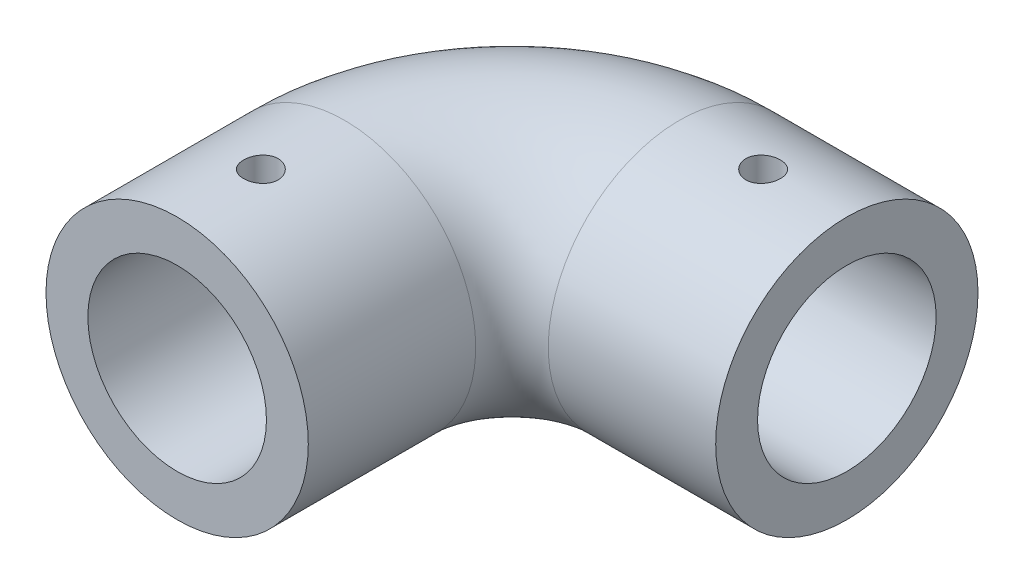
ISO-10303-21;
HEADER;
FILE_DESCRIPTION(('STEP AP214'),'2;1');
FILE_NAME('part.step','',(''),(''),'','','');
FILE_SCHEMA(('AUTOMOTIVE_DESIGN { 1 0 10303 214 1 1 1 1 }'));
ENDSEC;
DATA;
#1=APPLICATION_CONTEXT('core data for automotive mechanical design processes');
#2=APPLICATION_PROTOCOL_DEFINITION('international standard','automotive_design',2000,#1);
#3=PRODUCT_CONTEXT('',#1,'mechanical');
#4=PRODUCT('Part','Part','',(#3));
#5=PRODUCT_RELATED_PRODUCT_CATEGORY('part','',(#4));
#6=PRODUCT_DEFINITION_FORMATION('','',#4);
#7=PRODUCT_DEFINITION_CONTEXT('part definition',#1,'design');
#8=PRODUCT_DEFINITION('design','',#6,#7);
#9=PRODUCT_DEFINITION_SHAPE('','',#8);
#10=(LENGTH_UNIT() NAMED_UNIT(*) SI_UNIT(.MILLI.,.METRE.));
#11=(NAMED_UNIT(*) PLANE_ANGLE_UNIT() SI_UNIT($,.RADIAN.));
#12=(NAMED_UNIT(*) SI_UNIT($,.STERADIAN.) SOLID_ANGLE_UNIT());
#13=UNCERTAINTY_MEASURE_WITH_UNIT(LENGTH_MEASURE(1.E-05),#10,'distance_accuracy_value','');
#14=(GEOMETRIC_REPRESENTATION_CONTEXT(3) GLOBAL_UNCERTAINTY_ASSIGNED_CONTEXT((#13)) GLOBAL_UNIT_ASSIGNED_CONTEXT((#10,
#11,#12)) REPRESENTATION_CONTEXT('',''));
#15=CARTESIAN_POINT('',(0.,0.,0.));
#16=DIRECTION('',(0.,0.,1.));
#17=DIRECTION('',(1.,0.,0.));
#18=AXIS2_PLACEMENT_3D('',#15,#16,#17);
#19=CARTESIAN_POINT('',(0.,0.,0.));
#20=DIRECTION('',(0.,0.,-1.));
#21=DIRECTION('',(-1.,0.,0.));
#22=AXIS2_PLACEMENT_3D('',#19,#20,#21);
#23=CYLINDRICAL_SURFACE('',#22,23.5);
#24=CARTESIAN_POINT('',(0.,0.,-30.));
#25=DIRECTION('',(0.,0.,1.));
#26=DIRECTION('',(1.,0.,0.));
#27=AXIS2_PLACEMENT_3D('',#24,#25,#26);
#28=CIRCLE('',#27,23.5);
#29=CARTESIAN_POINT('',(-23.5,0.,-30.));
#30=VERTEX_POINT('',#29);
#31=EDGE_CURVE('E77',#30,#30,#28,.T.);
#32=ORIENTED_EDGE('',*,*,#31,.T.);
#33=EDGE_LOOP('',(#32));
#34=FACE_BOUND('',#33,.T.);
#35=CARTESIAN_POINT('',(0.,0.,0.));
#36=DIRECTION('',(0.,0.,1.));
#37=DIRECTION('',(1.,0.,0.));
#38=AXIS2_PLACEMENT_3D('',#35,#36,#37);
#39=CIRCLE('',#38,23.5);
#40=CARTESIAN_POINT('',(23.5,0.,0.));
#41=VERTEX_POINT('',#40);
#42=EDGE_CURVE('E72',#41,#41,#39,.T.);
#43=ORIENTED_EDGE('',*,*,#42,.F.);
#44=EDGE_LOOP('',(#43));
#45=FACE_BOUND('',#44,.T.);
#46=CARTESIAN_POINT('',(0.,23.5,-18.1));
#47=CARTESIAN_POINT('',(-0.173321031659221,23.4999974750277,-18.0999926879723));
#48=CARTESIAN_POINT('',(-0.346748373877283,23.4980623310897,-18.0854154023915));
#49=CARTESIAN_POINT('',(-0.688771561000183,23.4905288228196,-18.0274970424218));
#50=CARTESIAN_POINT('',(-0.857362263730753,23.4849267003003,-17.9841264579094));
#51=CARTESIAN_POINT('',(-1.18471161526422,23.4706899421908,-17.869926352));
#52=CARTESIAN_POINT('',(-1.34347700530939,23.462057413545,-17.7991159051159));
#53=CARTESIAN_POINT('',(-1.64684262133027,23.4427183403208,-17.632089166426));
#54=CARTESIAN_POINT('',(-1.79144515135038,23.4320121339395,-17.5358770164667));
#55=CARTESIAN_POINT('',(-2.06329159726113,23.4096467338321,-17.3201507293886));
#56=CARTESIAN_POINT('',(-2.1904365753566,23.3979826626349,-17.2005124091798));
#57=CARTESIAN_POINT('',(-2.42290623577125,23.3750551704837,-16.9415967283498));
#58=CARTESIAN_POINT('',(-2.52822977071607,23.3637917706228,-16.8023183356978));
#59=CARTESIAN_POINT('',(-2.71443987970265,23.3428931396758,-16.5074271751583));
#60=CARTESIAN_POINT('',(-2.79523293410607,23.3332641997659,-16.3517548696276));
#61=CARTESIAN_POINT('',(-2.92949133023861,23.3167897351994,-16.0289030431143));
#62=CARTESIAN_POINT('',(-2.98295782412488,23.3099440931945,-15.8617240076221));
#63=CARTESIAN_POINT('',(-3.06074291097747,23.2998583231461,-15.5216351148168));
#64=CARTESIAN_POINT('',(-3.08522922873764,23.2965974558618,-15.3487642454001));
#65=CARTESIAN_POINT('',(-3.10487804144976,23.2939871299961,-15.0013385734998));
#66=CARTESIAN_POINT('',(-3.10004184541014,23.2946374968102,-14.8267838465339));
#67=CARTESIAN_POINT('',(-3.06132043243985,23.2997571772921,-14.48211842091));
#68=CARTESIAN_POINT('',(-3.02762049659953,23.3042021322792,-14.3119864934336));
#69=CARTESIAN_POINT('',(-2.93241755235837,23.3163721509874,-13.9798137363208));
#70=CARTESIAN_POINT('',(-2.87091392232579,23.3240972880462,-13.8177730876784));
#71=CARTESIAN_POINT('',(-2.72165198002743,23.3419846827545,-13.5058101069335));
#72=CARTESIAN_POINT('',(-2.63381368125261,23.3521543462588,-13.3559264871891));
#73=CARTESIAN_POINT('',(-2.43443295967999,23.3737793095443,-13.0729566025147));
#74=CARTESIAN_POINT('',(-2.32288933019743,23.3852346747582,-12.9398711932226));
#75=CARTESIAN_POINT('',(-2.07823995961913,23.4082484325683,-12.6932005127998));
#76=CARTESIAN_POINT('',(-1.944974618275,23.4198069386001,-12.5797734847329));
#77=CARTESIAN_POINT('',(-1.66121281271497,23.4416421664452,-12.3768732446174));
#78=CARTESIAN_POINT('',(-1.51071630067848,23.4519188847009,-12.2874000990488));
#79=CARTESIAN_POINT('',(-1.19663825090432,23.4700400611114,-12.1349452562913));
#80=CARTESIAN_POINT('',(-1.03305155590709,23.477883554632,-12.0719740620867));
#81=CARTESIAN_POINT('',(-0.697499416434848,23.4902459944447,-11.9744393438919));
#82=CARTESIAN_POINT('',(-0.525534409619201,23.4947651141945,-11.9398743377243));
#83=CARTESIAN_POINT('',(-0.179474694334855,23.4999469701897,-11.9003396406468));
#84=CARTESIAN_POINT('',(-0.00540528485264608,23.5006380953205,-11.8951520764976));
#85=CARTESIAN_POINT('',(0.341120531277541,23.4981629029326,-11.9139436863675));
#86=CARTESIAN_POINT('',(0.513576976180813,23.4949966771351,-11.9379221668677));
#87=CARTESIAN_POINT('',(0.851334162606178,23.4851801832137,-12.0141841525573));
#88=CARTESIAN_POINT('',(1.01665889841815,23.4785427773227,-12.0663631861307));
#89=CARTESIAN_POINT('',(1.33621195496202,23.4625266475973,-12.1974360897373));
#90=CARTESIAN_POINT('',(1.4904398600971,23.4531478211581,-12.2763309596972));
#91=CARTESIAN_POINT('',(1.78439046543479,23.4326228068777,-12.4591189822996));
#92=CARTESIAN_POINT('',(1.92402527044779,23.4214668289037,-12.563152365068));
#93=CARTESIAN_POINT('',(2.18393028588585,23.3986645374708,-12.7930667241427));
#94=CARTESIAN_POINT('',(2.30419963612818,23.38701820226,-12.9189486704118));
#95=CARTESIAN_POINT('',(2.52273789291817,23.3644595819905,-13.1899492647444));
#96=CARTESIAN_POINT('',(2.6208619441624,23.3535524391162,-13.3351852170458));
#97=CARTESIAN_POINT('',(2.79132191851345,23.3337934467712,-13.6402047524404));
#98=CARTESIAN_POINT('',(2.86365840735405,23.3249415522134,-13.7999880162946));
#99=CARTESIAN_POINT('',(2.98025794321752,23.3103309523643,-14.129108328564));
#100=CARTESIAN_POINT('',(3.0246012468366,23.3045634115512,-14.2984165348526));
#101=CARTESIAN_POINT('',(3.08421340206133,23.2967496992326,-14.6421574008206));
#102=CARTESIAN_POINT('',(3.09948377325315,23.2947033332288,-14.8165897921848));
#103=CARTESIAN_POINT('',(3.1004865663258,23.2945697651086,-15.1641857933771));
#104=CARTESIAN_POINT('',(3.0864465971917,23.2964520550512,-15.3373487786282));
#105=CARTESIAN_POINT('',(3.02971073280373,23.3038979389888,-15.6788301006787));
#106=CARTESIAN_POINT('',(2.98701484577286,23.3094615319274,-15.8471484388683));
#107=CARTESIAN_POINT('',(2.87425276789381,23.3236333898471,-16.1741239240081));
#108=CARTESIAN_POINT('',(2.80419883831376,23.3322402907218,-16.3327853621985));
#109=CARTESIAN_POINT('',(2.63873161577431,23.351531066295,-16.636138360644));
#110=CARTESIAN_POINT('',(2.54331786303813,23.362214978649,-16.7808296675539));
#111=CARTESIAN_POINT('',(2.32899928379113,23.3845552389363,-17.0532969966543));
#112=CARTESIAN_POINT('',(2.20992503706964,23.396218227748,-17.1809392220424));
#113=CARTESIAN_POINT('',(1.95202104682625,23.4191446863472,-17.4145155753347));
#114=CARTESIAN_POINT('',(1.81318667151609,23.4304080616896,-17.5204445994031));
#115=CARTESIAN_POINT('',(1.51902435907111,23.4513194010269,-17.7079748817467));
#116=CARTESIAN_POINT('',(1.36362915815239,23.4609603325121,-17.789471370851));
#117=CARTESIAN_POINT('',(1.04131412298323,23.4774700636028,-17.9250931724008));
#118=CARTESIAN_POINT('',(0.87440688060979,23.4843418375185,-17.979247868155));
#119=CARTESIAN_POINT('',(0.588887061514348,23.4929050377411,-18.045859693053));
#120=CARTESIAN_POINT('',(0.472065863374174,23.4955525069536,-18.0661326590184));
#121=CARTESIAN_POINT('',(0.236846318196947,23.4991008433939,-18.0932052533571));
#122=CARTESIAN_POINT('',(0.118447984668329,23.5000017255718,-18.1000049970563));
#123=CARTESIAN_POINT('',(0.,23.5,-18.1));
#124=B_SPLINE_CURVE_WITH_KNOTS('',3,(#46,#47,#48,#49,#50,#51,#52,#53,#54,#55,#56,#57,#58,#59,
#60,#61,#62,#63,#64,#65,#66,#67,#68,#69,#70,#71,#72,#73,#74,#75,#76,#77,#78,#79,#80,#81,#82,#83,
#84,#85,#86,#87,#88,#89,#90,#91,#92,#93,#94,#95,#96,#97,#98,#99,#100,#101,#102,#103,#104,#105,
#106,#107,#108,#109,#110,#111,#112,#113,#114,#115,#116,#117,#118,#119,#120,#121,#122,#123),
.UNSPECIFIED.,.T.,.F.,(4,2,2,2,2,2,2,2,2,2,2,2,2,2,2,2,2,2,2,2,2,2,2,2,2,2,2,2,2,2,2,2,2,2,2,2,
2,2,4),(0.,0.519530399500838,1.03959408709146,1.55929690487302,2.07891503536618,
2.60136613547048,3.12384469915503,3.64829083977633,4.17271486659274,4.69408867501742,
5.21543920857269,5.7334679764832,6.25150832699316,6.77113834669579,7.29079482373352,
7.81445751118332,8.33812165195743,8.8619931310032,9.3858372737605,9.90579126828424,
10.4257328994296,10.9437614301756,11.4618093519598,11.9828166651779,12.5038471143324,
13.0281928147495,13.5525270112361,14.0753510290875,14.5981477191841,15.1168997458648,
15.6356516236864,16.1541712747392,16.6727003272594,17.1950855471704,17.7175934168279,
18.242310818308,18.7664631168658,19.1215144049266,19.476562653865),.UNSPECIFIED.);
#125=CARTESIAN_POINT('',(0.,23.5,-18.1));
#126=VERTEX_POINT('',#125);
#127=EDGE_CURVE('E81',#126,#126,#124,.T.);
#128=ORIENTED_EDGE('',*,*,#127,.F.);
#129=EDGE_LOOP('',(#128));
#130=FACE_BOUND('',#129,.T.);
#131=ADVANCED_FACE('F42',(#34,#45,#130),#23,.T.);
#132=CARTESIAN_POINT('',(30.,0.,-60.));
#133=DIRECTION('',(1.,0.,0.));
#134=DIRECTION('',(0.,0.,-1.));
#135=AXIS2_PLACEMENT_3D('',#132,#133,#134);
#136=CYLINDRICAL_SURFACE('',#135,23.5);
#137=CARTESIAN_POINT('',(60.,0.,-60.));
#138=DIRECTION('',(-1.,0.,0.));
#139=DIRECTION('',(0.,0.,1.));
#140=AXIS2_PLACEMENT_3D('',#137,#138,#139);
#141=CIRCLE('',#140,23.5);
#142=CARTESIAN_POINT('',(60.,0.,-36.5));
#143=VERTEX_POINT('',#142);
#144=EDGE_CURVE('E67',#143,#143,#141,.T.);
#145=ORIENTED_EDGE('',*,*,#144,.T.);
#146=EDGE_LOOP('',(#145));
#147=FACE_BOUND('',#146,.T.);
#148=CARTESIAN_POINT('',(30.,0.,-60.));
#149=DIRECTION('',(-1.,0.,0.));
#150=DIRECTION('',(0.,0.,1.));
#151=AXIS2_PLACEMENT_3D('',#148,#149,#150);
#152=CIRCLE('',#151,23.5);
#153=CARTESIAN_POINT('',(30.,0.,-83.5));
#154=VERTEX_POINT('',#153);
#155=EDGE_CURVE('E76',#154,#154,#152,.T.);
#156=ORIENTED_EDGE('',*,*,#155,.F.);
#157=EDGE_LOOP('',(#156));
#158=FACE_BOUND('',#157,.T.);
#159=CARTESIAN_POINT('',(45.,23.2946345753695,-63.1));
#160=CARTESIAN_POINT('',(44.8266863651519,23.2946371833884,-63.0999926815095));
#161=CARTESIAN_POINT('',(44.6532663984901,23.296589668208,-63.0854165981281));
#162=CARTESIAN_POINT('',(44.3112585339852,23.3041850941642,-63.0275034470105));
#163=CARTESIAN_POINT('',(44.1426757841507,23.3098318251612,-62.984136842925));
#164=CARTESIAN_POINT('',(43.8153432556061,23.3241652825432,-62.8699483791101));
#165=CARTESIAN_POINT('',(43.6565866683261,23.3328498755934,-62.7991457825216));
#166=CARTESIAN_POINT('',(43.3532358256197,23.3522779654423,-62.6321375355251));
#167=CARTESIAN_POINT('',(43.2086392769101,23.3630211280101,-62.5359360079493));
#168=CARTESIAN_POINT('',(42.9367861745401,23.3854306541838,-62.320220492036));
#169=CARTESIAN_POINT('',(42.8096304302013,23.3971018156634,-62.2005799437613));
#170=CARTESIAN_POINT('',(42.577139962798,23.4200092381534,-61.9416552732767));
#171=CARTESIAN_POINT('',(42.4718063540492,23.4312454769312,-61.8023701485552));
#172=CARTESIAN_POINT('',(42.2855856333531,23.4520664626879,-61.5074729927418));
#173=CARTESIAN_POINT('',(42.2047902121777,23.4616449593014,-61.3518025821873));
#174=CARTESIAN_POINT('',(42.0705269190027,23.4780183752079,-61.0289548711686));
#175=CARTESIAN_POINT('',(42.0170579221609,23.4848134090748,-60.8617780446665));
#176=CARTESIAN_POINT('',(41.9392677194548,23.4948204747855,-60.5216963097777));
#177=CARTESIAN_POINT('',(41.9147785312151,23.4980531483743,-60.3488304427694));
#178=CARTESIAN_POINT('',(41.8951222438988,23.5006418166413,-60.0014145947151));
#179=CARTESIAN_POINT('',(41.8999538677548,23.4999979801608,-59.8268646873481));
#180=CARTESIAN_POINT('',(41.9386679637062,23.4949228176469,-59.4821793079476));
#181=CARTESIAN_POINT('',(41.972369760162,23.4905150476453,-59.3120231471851));
#182=CARTESIAN_POINT('',(42.0675847951102,23.4784336494191,-58.9798028871826));
#183=CARTESIAN_POINT('',(42.1290986124743,23.4707599532185,-58.81773895645));
#184=CARTESIAN_POINT('',(42.2783818072552,23.4529683232353,-58.505747450077));
#185=CARTESIAN_POINT('',(42.3662288207267,23.4428431792591,-58.3558574499837));
#186=CARTESIAN_POINT('',(42.5656282278044,23.4212803374644,-58.0728784847576));
#187=CARTESIAN_POINT('',(42.6771818315393,23.4098425726555,-57.9397903778489));
#188=CARTESIAN_POINT('',(42.9218383755677,23.3868306298649,-57.6931306705566));
#189=CARTESIAN_POINT('',(43.0550988552713,23.3752560761816,-57.5797153082506));
#190=CARTESIAN_POINT('',(43.3388467425792,23.3533607274055,-57.3768363031228));
#191=CARTESIAN_POINT('',(43.4893342158604,23.343039937093,-57.2873727516199));
#192=CARTESIAN_POINT('',(43.8034096135024,23.3248209095298,-57.1349248511439));
#193=CARTESIAN_POINT('',(43.9670041320019,23.3169239014552,-57.0719539314341));
#194=CARTESIAN_POINT('',(44.3025733068676,23.3044699246918,-56.9744221502841));
#195=CARTESIAN_POINT('',(44.4745475111347,23.299912776024,-56.9398597579465));
#196=CARTESIAN_POINT('',(44.8206118246979,23.2946877542646,-56.9003349411788));
#197=CARTESIAN_POINT('',(44.994676353533,23.2939909373388,-56.8951522281696));
#198=CARTESIAN_POINT('',(45.3411912506484,23.2964888531997,-56.9139517985065));
#199=CARTESIAN_POINT('',(45.5136416572564,23.2996834933451,-56.9379333875582));
#200=CARTESIAN_POINT('',(45.8513671699699,23.3095779130641,-57.01419497752));
#201=CARTESIAN_POINT('',(46.0166669661415,23.3162643786448,-57.0663675151037));
#202=CARTESIAN_POINT('',(46.3361730094162,23.332378216681,-57.1974190954163));
#203=CARTESIAN_POINT('',(46.4903788248168,23.3418056957262,-57.276299176741));
#204=CARTESIAN_POINT('',(46.7843138597293,23.3624083654124,-57.459065142768));
#205=CARTESIAN_POINT('',(46.9239528467725,23.373593484388,-57.5630950069256));
#206=CARTESIAN_POINT('',(47.183867933741,23.3964203233942,-57.7930048611384));
#207=CARTESIAN_POINT('',(47.3041431924799,23.4080620632338,-57.9188857999401));
#208=CARTESIAN_POINT('',(47.5226949606356,23.4305797366314,-58.1898888615609));
#209=CARTESIAN_POINT('',(47.6208263946542,23.4414503171716,-58.3351284900591));
#210=CARTESIAN_POINT('',(47.7912993115932,23.46112002467,-58.6401574176883));
#211=CARTESIAN_POINT('',(47.8636413642415,23.4699191973874,-58.7999463953036));
#212=CARTESIAN_POINT('',(47.9802444233492,23.4844309865652,-59.1290637017235));
#213=CARTESIAN_POINT('',(48.0245880960434,23.490152681908,-59.2983623257172));
#214=CARTESIAN_POINT('',(48.0842042336789,23.4979026484711,-59.6420829221966));
#215=CARTESIAN_POINT('',(48.0994781663536,23.499931106163,-59.8165046355655));
#216=CARTESIAN_POINT('',(48.100491654618,23.5000649123544,-60.1641061740322));
#217=CARTESIAN_POINT('',(48.0864544542127,23.4981999148163,-60.3372853789739));
#218=CARTESIAN_POINT('',(48.029718434937,23.4908155123153,-60.6787998487685));
#219=CARTESIAN_POINT('',(47.9870196525229,23.4852961120007,-60.8471351197825));
#220=CARTESIAN_POINT('',(47.8742450615979,23.47122019862,-61.1741456511017));
#221=CARTESIAN_POINT('',(47.8041812004568,23.4626650111027,-61.3328250921674));
#222=CARTESIAN_POINT('',(47.6386885184084,23.4434628485903,-61.6362099739024));
#223=CARTESIAN_POINT('',(47.5432592580736,23.4328158373576,-61.7809151724242));
#224=CARTESIAN_POINT('',(47.3289232582396,23.4105205332277,-62.0533825620572));
#225=CARTESIAN_POINT('',(47.2098506684431,23.3988655155869,-62.1810137459619));
#226=CARTESIAN_POINT('',(46.9519545843131,23.3759206729334,-62.4145685934328));
#227=CARTESIAN_POINT('',(46.8131264325454,23.3646309348091,-62.5204871237627));
#228=CARTESIAN_POINT('',(46.518969546932,23.3436431007833,-62.7080056826632));
#229=CARTESIAN_POINT('',(46.3635724174795,23.333952058798,-62.7894991666997));
#230=CARTESIAN_POINT('',(46.04125337091,23.3173414588582,-62.9251148213319));
#231=CARTESIAN_POINT('',(45.8743440611273,23.3104189238033,-62.9792664104457));
#232=CARTESIAN_POINT('',(45.5888324885426,23.3017890970609,-63.0458697864461));
#233=CARTESIAN_POINT('',(45.4720221961832,23.2991197327602,-63.0661389518464));
#234=CARTESIAN_POINT('',(45.2368244786343,23.2955415885755,-63.0932064997098));
#235=CARTESIAN_POINT('',(45.1184370673925,23.2946327931317,-63.1000050012254));
#236=CARTESIAN_POINT('',(45.,23.2946345753695,-63.1));
#237=B_SPLINE_CURVE_WITH_KNOTS('',3,(#159,#160,#161,#162,#163,#164,#165,#166,#167,#168,#169,
#170,#171,#172,#173,#174,#175,#176,#177,#178,#179,#180,#181,#182,#183,#184,#185,#186,#187,#188,
#189,#190,#191,#192,#193,#194,#195,#196,#197,#198,#199,#200,#201,#202,#203,#204,#205,#206,#207,
#208,#209,#210,#211,#212,#213,#214,#215,#216,#217,#218,#219,#220,#221,#222,#223,#224,#225,#226,
#227,#228,#229,#230,#231,#232,#233,#234,#235,#236),.UNSPECIFIED.,.T.,.F.,(4,2,2,2,2,2,2,2,2,2,2,
2,2,2,2,2,2,2,2,2,2,2,2,2,2,2,2,2,2,2,2,2,2,2,2,2,2,2,4),(0.,0.519508177396211,1.03955014631105,
1.55922764714439,2.0788208441415,2.60130103089473,3.12380789076847,3.64824381526256,
4.17265815057344,4.69401757512779,5.21535429204776,5.73345201177922,6.2515605155497,
6.7712117969738,7.29088961093917,7.81452241554047,8.33815721652212,8.86205713202836,
9.38592881342047,9.90586726074958,10.4257933305088,10.9437512925747,11.4617293991632,
11.98274617339,12.5037855751788,13.0281453922087,13.5524936245896,14.0752863697817,
14.5980527184249,15.1168520200379,15.6356506617612,16.1542230529745,16.6728044284707,
17.1951608849717,17.7176406932592,18.2423675073137,18.7665285318696,19.1215471596138,
19.4765626497175),.UNSPECIFIED.);
#238=CARTESIAN_POINT('',(45.,23.2946345753695,-63.1));
#239=VERTEX_POINT('',#238);
#240=EDGE_CURVE('E92',#239,#239,#237,.T.);
#241=ORIENTED_EDGE('',*,*,#240,.F.);
#242=EDGE_LOOP('',(#241));
#243=FACE_BOUND('',#242,.T.);
#244=ADVANCED_FACE('F44',(#147,#158,#243),#136,.T.);
#245=CARTESIAN_POINT('',(0.,0.,0.));
#246=DIRECTION('',(0.,0.,-1.));
#247=DIRECTION('',(-1.,0.,0.));
#248=AXIS2_PLACEMENT_3D('',#245,#246,#247);
#249=CYLINDRICAL_SURFACE('',#248,16.);
#250=CARTESIAN_POINT('',(0.,0.,-30.));
#251=DIRECTION('',(0.,0.,1.));
#252=DIRECTION('',(1.,0.,0.));
#253=AXIS2_PLACEMENT_3D('',#250,#251,#252);
#254=CIRCLE('',#253,16.);
#255=CARTESIAN_POINT('',(-16.,0.,-30.));
#256=VERTEX_POINT('',#255);
#257=EDGE_CURVE('E63',#256,#256,#254,.F.);
#258=ORIENTED_EDGE('',*,*,#257,.T.);
#259=EDGE_LOOP('',(#258));
#260=FACE_BOUND('',#259,.T.);
#261=CARTESIAN_POINT('',(0.,0.,0.));
#262=DIRECTION('',(0.,0.,1.));
#263=DIRECTION('',(1.,0.,0.));
#264=AXIS2_PLACEMENT_3D('',#261,#262,#263);
#265=CIRCLE('',#264,16.);
#266=CARTESIAN_POINT('',(16.,0.,0.));
#267=VERTEX_POINT('',#266);
#268=EDGE_CURVE('E71',#267,#267,#265,.F.);
#269=ORIENTED_EDGE('',*,*,#268,.F.);
#270=EDGE_LOOP('',(#269));
#271=FACE_BOUND('',#270,.T.);
#272=CARTESIAN_POINT('',(0.,16.,-18.1));
#273=CARTESIAN_POINT('',(0.172400018112145,15.9999968456064,-18.0999935298753));
#274=CARTESIAN_POINT('',(0.344883029164546,15.9971848990053,-18.0855699046947));
#275=CARTESIAN_POINT('',(0.684981234895933,15.9862386155697,-18.0282979104418));
#276=CARTESIAN_POINT('',(0.852592322333152,15.9780999166224,-17.9854262446817));
#277=CARTESIAN_POINT('',(1.17797958743562,15.9574097508782,-17.8726261411896));
#278=CARTESIAN_POINT('',(1.3357647548257,15.9448623895201,-17.8027228697845));
#279=CARTESIAN_POINT('',(1.63735453579116,15.9167220293397,-17.6379169531352));
#280=CARTESIAN_POINT('',(1.78116013220058,15.9011292448583,-17.5430160670916));
#281=CARTESIAN_POINT('',(2.05255470032449,15.8683944156927,-17.3296253502588));
#282=CARTESIAN_POINT('',(2.17993972734014,15.8512367122421,-17.2108785144865));
#283=CARTESIAN_POINT('',(2.4131120440203,15.8174209076797,-16.9537193563812));
#284=CARTESIAN_POINT('',(2.51889771675434,15.8007628440505,-16.8153055630917));
#285=CARTESIAN_POINT('',(2.70672648568412,15.7696798658713,-16.5212875769414));
#286=CARTESIAN_POINT('',(2.78856028948406,15.7552751206221,-16.3655473605006));
#287=CARTESIAN_POINT('',(2.92482206538374,15.7305512478739,-16.0422030560604));
#288=CARTESIAN_POINT('',(2.97925256938511,15.7202317429418,-15.8746000657433));
#289=CARTESIAN_POINT('',(3.05850440191015,15.7050047812111,-15.5344760351946));
#290=CARTESIAN_POINT('',(3.08368246958737,15.7000321749414,-15.3620410935737));
#291=CARTESIAN_POINT('',(3.10482239355997,15.6958657682352,-15.0153281684222));
#292=CARTESIAN_POINT('',(3.10078705010488,15.6966714139248,-14.8410503631383));
#293=CARTESIAN_POINT('',(3.06390355483122,15.7039112280578,-14.4981958412494));
#294=CARTESIAN_POINT('',(3.03146267555963,15.7102658331955,-14.3295733817728));
#295=CARTESIAN_POINT('',(2.93933110318011,15.7277624399498,-14.000210568688));
#296=CARTESIAN_POINT('',(2.8796391812807,15.7389046574459,-13.839470570874));
#297=CARTESIAN_POINT('',(2.73430630418926,15.7648033139657,-13.5292526848228));
#298=CARTESIAN_POINT('',(2.64850238875346,15.779582335459,-13.3798531045363));
#299=CARTESIAN_POINT('',(2.45349629943698,15.8110746598553,-13.0974193460857));
#300=CARTESIAN_POINT('',(2.34429159574694,15.8277881718022,-12.9643869397915));
#301=CARTESIAN_POINT('',(2.1033955184752,15.861611985366,-12.7161122134612));
#302=CARTESIAN_POINT('',(1.97135615868376,15.8787242267367,-12.6012075356388));
#303=CARTESIAN_POINT('',(1.68969934988837,15.9111589528458,-12.3951265519363));
#304=CARTESIAN_POINT('',(1.54008170125095,15.9264814172542,-12.303950515576));
#305=CARTESIAN_POINT('',(1.22715196450817,15.9536443322074,-12.1478589789125));
#306=CARTESIAN_POINT('',(1.06382105460123,15.9654798930777,-12.0829803078974));
#307=CARTESIAN_POINT('',(0.728298252432353,15.9842980154045,-11.9816756927031));
#308=CARTESIAN_POINT('',(0.556107368742883,15.9912811279311,-11.945246517588));
#309=CARTESIAN_POINT('',(0.210655679356111,15.9995313338875,-11.9023489140451));
#310=CARTESIAN_POINT('',(0.0374543269331827,16.0008866274512,-11.8954181381819));
#311=CARTESIAN_POINT('',(-0.307631973890057,15.9979727903373,-11.9104714301758));
#312=CARTESIAN_POINT('',(-0.479516991064483,15.993703955546,-11.932453976898));
#313=CARTESIAN_POINT('',(-0.815612592818186,15.9800765683561,-12.0043256442303));
#314=CARTESIAN_POINT('',(-0.979875446450592,15.9707609975382,-12.0539791998503));
#315=CARTESIAN_POINT('',(-1.29774441124377,15.9480805821999,-12.1795272568736));
#316=CARTESIAN_POINT('',(-1.45134976038428,15.9347154484984,-12.2554236323432));
#317=CARTESIAN_POINT('',(-1.74550515636655,15.9051985298092,-12.4323148376324));
#318=CARTESIAN_POINT('',(-1.88588342117606,15.8890162670631,-12.5335901353314));
#319=CARTESIAN_POINT('',(-2.14781862835062,15.8557352328478,-12.7579867977836));
#320=CARTESIAN_POINT('',(-2.26937368319547,15.8386363696963,-12.881110350744));
#321=CARTESIAN_POINT('',(-2.49198242490859,15.8051543551885,-13.1478074408912));
#322=CARTESIAN_POINT('',(-2.59271964826137,15.7887848565809,-13.2916471310448));
#323=CARTESIAN_POINT('',(-2.76860335047013,15.7588967655036,-13.5944781599157));
#324=CARTESIAN_POINT('',(-2.84375081816112,15.7453780628816,-13.7534689128642));
#325=CARTESIAN_POINT('',(-2.9658813250644,15.7228308818565,-14.0813116555176));
#326=CARTESIAN_POINT('',(-3.01300540655565,15.7137799568737,-14.2501094864172));
#327=CARTESIAN_POINT('',(-3.07818300321725,15.7011436280101,-14.5934201254523));
#328=CARTESIAN_POINT('',(-3.09624004793599,15.6975575605462,-14.7679322370887));
#329=CARTESIAN_POINT('',(-3.1026466970072,15.6962922080779,-15.1145441633165));
#330=CARTESIAN_POINT('',(-3.09149591006534,15.6985135837723,-15.2866345770693));
#331=CARTESIAN_POINT('',(-3.04090159079807,15.7083917232253,-15.6264376497712));
#332=CARTESIAN_POINT('',(-3.00145825542867,15.7160484491463,-15.794150339187));
#333=CARTESIAN_POINT('',(-2.89561528379259,15.735891455948,-16.1201442529648));
#334=CARTESIAN_POINT('',(-2.82927328241623,15.748068047576,-16.2784448179908));
#335=CARTESIAN_POINT('',(-2.67157212299307,15.7755849745109,-16.581747452949));
#336=CARTESIAN_POINT('',(-2.5802110334981,15.7909255540517,-16.7267484950174));
#337=CARTESIAN_POINT('',(-2.37334319348696,15.8233481573614,-17.0018313873299));
#338=CARTESIAN_POINT('',(-2.2574742072409,15.8404540754124,-17.1316380610404));
#339=CARTESIAN_POINT('',(-2.00563140363589,15.8743048001568,-17.3701316522386));
#340=CARTESIAN_POINT('',(-1.86965297449189,15.8910495230036,-17.4788137118607));
#341=CARTESIAN_POINT('',(-1.57986614563194,15.9224824943387,-17.6729646970761));
#342=CARTESIAN_POINT('',(-1.42589737475359,15.9371491858597,-17.7581978715211));
#343=CARTESIAN_POINT('',(-1.10558592486329,15.9625622940216,-17.9014480879311));
#344=CARTESIAN_POINT('',(-0.939254802441118,15.9733123179043,-17.9594901869701));
#345=CARTESIAN_POINT('',(-0.643742122325789,15.9875398674044,-18.0351926193321));
#346=CARTESIAN_POINT('',(-0.516266375684655,15.9921855603691,-18.0594529750441));
#347=CARTESIAN_POINT('',(-0.25920935289881,15.9984167689844,-18.0918588683307));
#348=CARTESIAN_POINT('',(-0.129628136832457,16.0000023717988,-18.1000048649079));
#349=CARTESIAN_POINT('',(0.,16.,-18.1));
#350=B_SPLINE_CURVE_WITH_KNOTS('',3,(#272,#273,#274,#275,#276,#277,#278,#279,#280,#281,#282,
#283,#284,#285,#286,#287,#288,#289,#290,#291,#292,#293,#294,#295,#296,#297,#298,#299,#300,#301,
#302,#303,#304,#305,#306,#307,#308,#309,#310,#311,#312,#313,#314,#315,#316,#317,#318,#319,#320,
#321,#322,#323,#324,#325,#326,#327,#328,#329,#330,#331,#332,#333,#334,#335,#336,#337,#338,#339,
#340,#341,#342,#343,#344,#345,#346,#347,#348,#349),.UNSPECIFIED.,.T.,.F.,(4,2,2,2,2,2,2,2,2,2,2,
2,2,2,2,2,2,2,2,2,2,2,2,2,2,2,2,2,2,2,2,2,2,2,2,2,2,2,4),(0.,0.51672591763908,1.03387551589591,
1.55054480441659,2.06717774218177,2.58971052839545,3.11228241715123,3.63929284169406,
4.16625456467356,4.68672009808957,5.20713574297819,5.72020975490253,6.23330690440955,
6.749674255287,7.26609745772704,7.79122490362681,8.31635831388138,8.84222464984578,
9.36803125584057,9.88556548842531,10.4030724945356,10.9162397868457,11.4294437333038,
11.9485906959877,12.4677896830993,12.9943793639277,13.5209486940572,14.0448448532419,
14.5686773920312,15.0836083659735,15.5985357553053,16.1123656085652,16.626235140155,
17.1483094818336,17.6705037392719,18.1977706603895,18.7245507349377,19.1130897078368,
19.5016176134025),.UNSPECIFIED.);
#351=CARTESIAN_POINT('',(0.,16.,-18.1));
#352=VERTEX_POINT('',#351);
#353=EDGE_CURVE('E47',#352,#352,#350,.T.);
#354=ORIENTED_EDGE('',*,*,#353,.F.);
#355=EDGE_LOOP('',(#354));
#356=FACE_BOUND('',#355,.T.);
#357=ADVANCED_FACE('F105',(#260,#271,#356),#249,.F.);
#358=CARTESIAN_POINT('',(30.,0.,-60.));
#359=DIRECTION('',(1.,0.,0.));
#360=DIRECTION('',(0.,0.,-1.));
#361=AXIS2_PLACEMENT_3D('',#358,#359,#360);
#362=CYLINDRICAL_SURFACE('',#361,16.);
#363=CARTESIAN_POINT('',(60.,0.,-60.));
#364=DIRECTION('',(-1.,0.,0.));
#365=DIRECTION('',(0.,0.,1.));
#366=AXIS2_PLACEMENT_3D('',#363,#364,#365);
#367=CIRCLE('',#366,16.);
#368=CARTESIAN_POINT('',(60.,0.,-44.));
#369=VERTEX_POINT('',#368);
#370=EDGE_CURVE('E10',#369,#369,#367,.F.);
#371=ORIENTED_EDGE('',*,*,#370,.T.);
#372=EDGE_LOOP('',(#371));
#373=FACE_BOUND('',#372,.T.);
#374=CARTESIAN_POINT('',(30.,0.,-60.));
#375=DIRECTION('',(-1.,0.,0.));
#376=DIRECTION('',(0.,0.,1.));
#377=AXIS2_PLACEMENT_3D('',#374,#375,#376);
#378=CIRCLE('',#377,16.);
#379=CARTESIAN_POINT('',(30.,0.,-76.));
#380=VERTEX_POINT('',#379);
#381=EDGE_CURVE('E57',#380,#380,#378,.F.);
#382=ORIENTED_EDGE('',*,*,#381,.F.);
#383=EDGE_LOOP('',(#382));
#384=FACE_BOUND('',#383,.T.);
#385=CARTESIAN_POINT('',(45.,15.6968149635523,-63.1));
#386=CARTESIAN_POINT('',(45.1723657822955,15.6968183496216,-63.0999935030711));
#387=CARTESIAN_POINT('',(45.344814630871,15.6996849201372,-63.0855754121256));
#388=CARTESIAN_POINT('',(45.6848418986608,15.7108259393092,-63.0283273917692));
#389=CARTESIAN_POINT('',(45.8524161827763,15.7191048471173,-62.9854740344889));
#390=CARTESIAN_POINT('',(46.1777255126463,15.7400985011718,-62.8727274586839));
#391=CARTESIAN_POINT('',(46.3354698599396,15.7528089765626,-62.8028602672905));
#392=CARTESIAN_POINT('',(46.6369908492574,15.7812285492128,-62.6381393955735));
#393=CARTESIAN_POINT('',(46.7807684270475,15.7969374453702,-62.5432873908009));
#394=CARTESIAN_POINT('',(47.052192988685,15.8298168927072,-62.3299467414366));
#395=CARTESIAN_POINT('',(47.1796275344832,15.8470026199223,-62.2111901176444));
#396=CARTESIAN_POINT('',(47.4128958929896,15.8807655247417,-61.9539903788593));
#397=CARTESIAN_POINT('',(47.5187282408702,15.8973426610155,-61.81554592993));
#398=CARTESIAN_POINT('',(47.7066071557333,15.9281837127631,-61.5214994571302));
#399=CARTESIAN_POINT('',(47.7884526436,15.9424276546092,-61.3657666807564));
#400=CARTESIAN_POINT('',(47.9247380518119,15.9668272400703,-61.0424384764338));
#401=CARTESIAN_POINT('',(47.9791803786151,15.9769832426592,-60.8748440916085));
#402=CARTESIAN_POINT('',(48.0584549583422,15.9919554403754,-60.5347531125742));
#403=CARTESIAN_POINT('',(48.083645638706,15.9968362215568,-60.3623429576502));
#404=CARTESIAN_POINT('',(48.1048193853687,16.0009308779718,-60.0156790612767));
#405=CARTESIAN_POINT('',(48.1008051000208,16.000145267043,-59.8414254884223));
#406=CARTESIAN_POINT('',(48.0639562610778,15.9930459187041,-59.4984816400138));
#407=CARTESIAN_POINT('',(48.0315077162765,15.9868062259159,-59.3297481333213));
#408=CARTESIAN_POINT('',(47.9393228244481,15.9695830781121,-59.0001672418026));
#409=CARTESIAN_POINT('',(47.8795854341101,15.9585994417262,-58.8393201587517));
#410=CARTESIAN_POINT('',(47.7341558094403,15.932999622013,-58.5289674096771));
#411=CARTESIAN_POINT('',(47.6483107860114,15.9183621483175,-58.379535167716));
#412=CARTESIAN_POINT('',(47.4532155332932,15.8870708907019,-58.0970532447862));
#413=CARTESIAN_POINT('',(47.3439627692152,15.8704168885,-57.9640053405118));
#414=CARTESIAN_POINT('',(47.1030308607987,15.836613083932,-57.7157799162411));
#415=CARTESIAN_POINT('',(46.9710139474347,15.8194596280122,-57.600930501416));
#416=CARTESIAN_POINT('',(46.6894223218532,15.7868497690065,-57.3949505632986));
#417=CARTESIAN_POINT('',(46.5398473170883,15.7713933942051,-57.3038204352911));
#418=CARTESIAN_POINT('',(46.2269325791426,15.7439214708599,-57.1477627546255));
#419=CARTESIAN_POINT('',(46.0635671142788,15.731912547157,-57.0828855546063));
#420=CARTESIAN_POINT('',(45.7279687138558,15.7127944905322,-56.981594301497));
#421=CARTESIAN_POINT('',(45.5557368596436,15.7056847616177,-56.9451767861814));
#422=CARTESIAN_POINT('',(45.2102608105057,15.6972887358598,-56.9023232783569));
#423=CARTESIAN_POINT('',(45.037077403121,15.6959106572924,-56.89541470604));
#424=CARTESIAN_POINT('',(44.6920321840123,15.6988879836994,-56.9105059931666));
#425=CARTESIAN_POINT('',(44.5201703027204,15.7032430847601,-56.9325043202663));
#426=CARTESIAN_POINT('',(44.1842174199665,15.7171103411177,-57.0043784052294));
#427=CARTESIAN_POINT('',(44.0200708318644,15.7265762103354,-57.0540040774761));
#428=CARTESIAN_POINT('',(43.7024221743492,15.7495582114621,-57.179457802111));
#429=CARTESIAN_POINT('',(43.5489209364598,15.7630746593298,-57.2552878986029));
#430=CARTESIAN_POINT('',(43.2548452949425,15.7928424778295,-57.4320767764947));
#431=CARTESIAN_POINT('',(43.1144527780162,15.8091253946853,-57.5333326995148));
#432=CARTESIAN_POINT('',(42.85247990556,15.8425038206338,-57.7577005324747));
#433=CARTESIAN_POINT('',(42.7309013637186,15.8595994078615,-57.8808145471058));
#434=CARTESIAN_POINT('',(42.5082291598102,15.8929733202183,-58.1475198325924));
#435=CARTESIAN_POINT('',(42.4074541672091,15.9092364149612,-58.2913793708786));
#436=CARTESIAN_POINT('',(42.2315042752847,15.9388524851967,-58.5942613982288));
#437=CARTESIAN_POINT('',(42.1563283449352,15.9522055778846,-58.753283276285));
#438=CARTESIAN_POINT('',(42.0341814156017,15.9744318423168,-59.0811165467786));
#439=CARTESIAN_POINT('',(41.9870571874884,15.9833293092159,-59.2498691279366));
#440=CARTESIAN_POINT('',(41.9218640135752,15.9957457390232,-59.5930833074098));
#441=CARTESIAN_POINT('',(41.9037917934594,15.999265308047,-59.7675442600994));
#442=CARTESIAN_POINT('',(41.8973359560532,16.0005162071861,-60.1141728865245));
#443=CARTESIAN_POINT('',(41.9084721275452,15.9983411627249,-60.2863314609554));
#444=CARTESIAN_POINT('',(41.959061003305,15.988642907397,-60.6262747513843));
#445=CARTESIAN_POINT('',(41.9985133954858,15.9811197554745,-60.794059515567));
#446=CARTESIAN_POINT('',(42.1044069323445,15.9615718745203,-61.1202161803788));
#447=CARTESIAN_POINT('',(42.1707937081926,15.949556217717,-61.2786063107791));
#448=CARTESIAN_POINT('',(42.3286124605679,15.9223206098035,-61.5820697464878));
#449=CARTESIAN_POINT('',(42.4200462653205,15.9071004248081,-61.727142078675));
#450=CARTESIAN_POINT('',(42.6270002917152,15.8748401429673,-62.0022357440289));
#451=CARTESIAN_POINT('',(42.7428657985176,15.8577758810491,-62.1319945136472));
#452=CARTESIAN_POINT('',(42.9946811449264,15.8238987286743,-62.3703930687062));
#453=CARTESIAN_POINT('',(43.1306357162,15.8070858984686,-62.479027864724));
#454=CARTESIAN_POINT('',(43.420397419412,15.7754309559611,-62.6731202961452));
#455=CARTESIAN_POINT('',(43.5743693495592,15.760610212011,-62.7583355174493));
#456=CARTESIAN_POINT('',(43.8946859695538,15.7348764616018,-62.9015513282117));
#457=CARTESIAN_POINT('',(44.0610190375047,15.7239598392643,-62.9595771152307));
#458=CARTESIAN_POINT('',(44.356489725923,15.7094989457674,-63.0352395994726));
#459=CARTESIAN_POINT('',(44.4839189364867,15.7047713022453,-63.0594822328548));
#460=CARTESIAN_POINT('',(44.7408831586877,15.698428086035,-63.0918646284777));
#461=CARTESIAN_POINT('',(44.8704181056571,15.6968124179585,-63.1000048842893));
#462=CARTESIAN_POINT('',(45.,15.6968149635523,-63.1));
#463=B_SPLINE_CURVE_WITH_KNOTS('',3,(#385,#386,#387,#388,#389,#390,#391,#392,#393,#394,#395,
#396,#397,#398,#399,#400,#401,#402,#403,#404,#405,#406,#407,#408,#409,#410,#411,#412,#413,#414,
#415,#416,#417,#418,#419,#420,#421,#422,#423,#424,#425,#426,#427,#428,#429,#430,#431,#432,#433,
#434,#435,#436,#437,#438,#439,#440,#441,#442,#443,#444,#445,#446,#447,#448,#449,#450,#451,#452,
#453,#454,#455,#456,#457,#458,#459,#460,#461,#462),.UNSPECIFIED.,.T.,.F.,(4,2,2,2,2,2,2,2,2,2,2,
2,2,2,2,2,2,2,2,2,2,2,2,2,2,2,2,2,2,2,2,2,2,2,2,2,2,2,4),(0.,0.516623016732661,1.03367220952937,
1.55022447518393,2.06674210822344,2.58940956709488,3.11211245585899,3.63907937569787,
4.16600001090829,4.68639366223692,5.20674012402021,5.7201301971063,6.23353989983441,
6.75001400299455,7.2665440626479,7.79152770250687,8.31652009071937,8.84251468581588,
9.36844528176662,9.88592086212843,10.4033690124148,10.9162075910363,11.4290861832021,
11.9482628457081,12.4674895262913,12.9941600853018,13.5208094296541,14.0445549680028,
14.5682414733022,15.0833722971905,15.5984974436521,16.1125879087572,16.6267159082053,
17.1486658078892,17.670738841308,18.1980280537372,18.7248276344747,19.1132286289989,
19.5016177180502),.UNSPECIFIED.);
#464=CARTESIAN_POINT('',(45.,15.6968149635523,-63.1));
#465=VERTEX_POINT('',#464);
#466=EDGE_CURVE('E84',#465,#465,#463,.T.);
#467=ORIENTED_EDGE('',*,*,#466,.F.);
#468=EDGE_LOOP('',(#467));
#469=FACE_BOUND('',#468,.T.);
#470=ADVANCED_FACE('F93',(#373,#384,#469),#362,.F.);
#471=CARTESIAN_POINT('',(30.,0.,-30.));
#472=DIRECTION('',(0.,-1.,0.));
#473=DIRECTION('',(0.,0.,-1.));
#474=AXIS2_PLACEMENT_3D('',#471,#472,#473);
#475=TOROIDAL_SURFACE('',#474,30.,23.5);
#476=CARTESIAN_POINT('',(30.,0.,-30.));
#477=DIRECTION('',(0.,-1.,0.));
#478=DIRECTION('',(0.,0.,-1.));
#479=AXIS2_PLACEMENT_3D('',#476,#477,#478);
#480=CIRCLE('',#479,53.5);
#481=EDGE_CURVE('',#30,#154,#480,.T.);
#482=ORIENTED_EDGE('',*,*,#31,.F.);
#483=ORIENTED_EDGE('',*,*,#155,.T.);
#484=ORIENTED_EDGE('',*,*,#481,.T.);
#485=ORIENTED_EDGE('',*,*,#481,.F.);
#486=EDGE_LOOP('',(#482,#484,#483,#485));
#487=FACE_BOUND('',#486,.T.);
#488=ADVANCED_FACE('F103',(#487),#475,.T.);
#489=CARTESIAN_POINT('',(0.,0.,0.));
#490=DIRECTION('',(0.,0.,1.));
#491=DIRECTION('',(1.,0.,0.));
#492=AXIS2_PLACEMENT_3D('',#489,#490,#491);
#493=PLANE('',#492);
#494=ORIENTED_EDGE('',*,*,#268,.T.);
#495=EDGE_LOOP('',(#494));
#496=FACE_BOUND('',#495,.T.);
#497=ORIENTED_EDGE('',*,*,#42,.T.);
#498=EDGE_LOOP('',(#497));
#499=FACE_BOUND('',#498,.T.);
#500=ADVANCED_FACE('F126',(#496,#499),#493,.T.);
#501=CARTESIAN_POINT('',(60.,0.,-60.));
#502=DIRECTION('',(-1.,0.,0.));
#503=DIRECTION('',(0.,0.,1.));
#504=AXIS2_PLACEMENT_3D('',#501,#502,#503);
#505=PLANE('',#504);
#506=ORIENTED_EDGE('',*,*,#370,.F.);
#507=EDGE_LOOP('',(#506));
#508=FACE_BOUND('',#507,.T.);
#509=ORIENTED_EDGE('',*,*,#144,.F.);
#510=EDGE_LOOP('',(#509));
#511=FACE_BOUND('',#510,.T.);
#512=ADVANCED_FACE('F132',(#508,#511),#505,.F.);
#513=CARTESIAN_POINT('',(30.,0.,-30.));
#514=DIRECTION('',(0.,-1.,0.));
#515=DIRECTION('',(0.,0.,-1.));
#516=AXIS2_PLACEMENT_3D('',#513,#514,#515);
#517=TOROIDAL_SURFACE('',#516,30.,16.);
#518=CARTESIAN_POINT('',(30.,0.,-30.));
#519=DIRECTION('',(0.,-1.,0.));
#520=DIRECTION('',(0.,0.,-1.));
#521=AXIS2_PLACEMENT_3D('',#518,#519,#520);
#522=CIRCLE('',#521,46.);
#523=EDGE_CURVE('',#256,#380,#522,.T.);
#524=ORIENTED_EDGE('',*,*,#257,.F.);
#525=ORIENTED_EDGE('',*,*,#381,.T.);
#526=ORIENTED_EDGE('',*,*,#523,.T.);
#527=ORIENTED_EDGE('',*,*,#523,.F.);
#528=EDGE_LOOP('',(#524,#526,#525,#527));
#529=FACE_BOUND('',#528,.T.);
#530=ADVANCED_FACE('F101',(#529),#517,.F.);
#531=CARTESIAN_POINT('',(45.,40.,-60.));
#532=DIRECTION('',(0.,-1.,0.));
#533=DIRECTION('',(0.,0.,-1.));
#534=AXIS2_PLACEMENT_3D('',#531,#532,#533);
#535=CYLINDRICAL_SURFACE('',#534,3.1);
#536=ORIENTED_EDGE('',*,*,#466,.T.);
#537=EDGE_LOOP('',(#536));
#538=FACE_BOUND('',#537,.T.);
#539=ORIENTED_EDGE('',*,*,#240,.T.);
#540=EDGE_LOOP('',(#539));
#541=FACE_BOUND('',#540,.T.);
#542=ADVANCED_FACE('F97',(#538,#541),#535,.F.);
#543=CARTESIAN_POINT('',(0.,40.,-15.));
#544=DIRECTION('',(0.,-1.,0.));
#545=DIRECTION('',(0.,0.,-1.));
#546=AXIS2_PLACEMENT_3D('',#543,#544,#545);
#547=CYLINDRICAL_SURFACE('',#546,3.1);
#548=ORIENTED_EDGE('',*,*,#353,.T.);
#549=EDGE_LOOP('',(#548));
#550=FACE_BOUND('',#549,.T.);
#551=ORIENTED_EDGE('',*,*,#127,.T.);
#552=EDGE_LOOP('',(#551));
#553=FACE_BOUND('',#552,.T.);
#554=ADVANCED_FACE('F100',(#550,#553),#547,.F.);
#555=CLOSED_SHELL('',(#131,#244,#357,#470,#488,#500,#512,#530,#542,#554));
#556=MANIFOLD_SOLID_BREP('B2',#555);
#557=ADVANCED_BREP_SHAPE_REPRESENTATION('',(#18,#556),#14);
#558=SHAPE_DEFINITION_REPRESENTATION(#9,#557);
ENDSEC;
END-ISO-10303-21;
